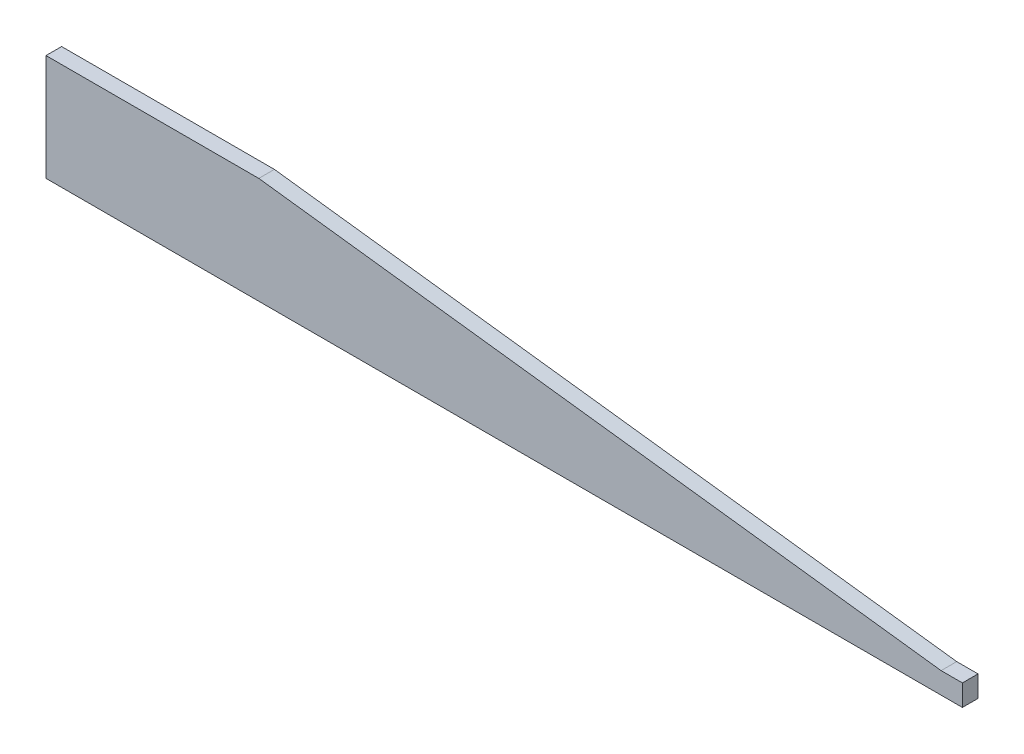
ISO-10303-21;
HEADER;
FILE_DESCRIPTION(('STEP AP214'),'2;1');
FILE_NAME('part.step','',(''),(''),'','','');
FILE_SCHEMA(('AUTOMOTIVE_DESIGN { 1 0 10303 214 1 1 1 1 }'));
ENDSEC;
DATA;
#1=APPLICATION_CONTEXT('core data for automotive mechanical design processes');
#2=APPLICATION_PROTOCOL_DEFINITION('international standard','automotive_design',2000,#1);
#3=PRODUCT_CONTEXT('',#1,'mechanical');
#4=PRODUCT('Part','Part','',(#3));
#5=PRODUCT_RELATED_PRODUCT_CATEGORY('part','',(#4));
#6=PRODUCT_DEFINITION_FORMATION('','',#4);
#7=PRODUCT_DEFINITION_CONTEXT('part definition',#1,'design');
#8=PRODUCT_DEFINITION('design','',#6,#7);
#9=PRODUCT_DEFINITION_SHAPE('','',#8);
#10=(LENGTH_UNIT() NAMED_UNIT(*) SI_UNIT(.MILLI.,.METRE.));
#11=(NAMED_UNIT(*) PLANE_ANGLE_UNIT() SI_UNIT($,.RADIAN.));
#12=(NAMED_UNIT(*) SI_UNIT($,.STERADIAN.) SOLID_ANGLE_UNIT());
#13=UNCERTAINTY_MEASURE_WITH_UNIT(LENGTH_MEASURE(1.E-05),#10,'distance_accuracy_value','');
#14=(GEOMETRIC_REPRESENTATION_CONTEXT(3) GLOBAL_UNCERTAINTY_ASSIGNED_CONTEXT((#13)) GLOBAL_UNIT_ASSIGNED_CONTEXT((#10,
#11,#12)) REPRESENTATION_CONTEXT('',''));
#15=CARTESIAN_POINT('',(0.,0.,0.));
#16=DIRECTION('',(0.,0.,1.));
#17=DIRECTION('',(1.,0.,0.));
#18=AXIS2_PLACEMENT_3D('',#15,#16,#17);
#19=CARTESIAN_POINT('',(-0.0100000000000477,-150.01,22.));
#20=DIRECTION('',(0.,0.,1.));
#21=DIRECTION('',(1.,0.,0.));
#22=AXIS2_PLACEMENT_3D('',#19,#20,#21);
#23=PLANE('',#22);
#24=DIRECTION('',(0.,1.,0.));
#25=VECTOR('',#24,1.);
#26=CARTESIAN_POINT('',(0.,-75.,22.));
#27=LINE('',#26,#25);
#28=CARTESIAN_POINT('',(0.,-150.,22.));
#29=VERTEX_POINT('',#28);
#30=CARTESIAN_POINT('',(0.,0.,22.));
#31=VERTEX_POINT('',#30);
#32=EDGE_CURVE('E100',#29,#31,#27,.T.);
#33=ORIENTED_EDGE('',*,*,#32,.F.);
#34=DIRECTION('',(-1.,0.,0.));
#35=VECTOR('',#34,1.);
#36=CARTESIAN_POINT('',(646.,-150.,22.));
#37=LINE('',#36,#35);
#38=CARTESIAN_POINT('',(1292.,-150.,22.));
#39=VERTEX_POINT('',#38);
#40=EDGE_CURVE('E95',#39,#29,#37,.T.);
#41=ORIENTED_EDGE('',*,*,#40,.F.);
#42=DIRECTION('',(0.,-1.,0.));
#43=VECTOR('',#42,1.);
#44=CARTESIAN_POINT('',(1292.,-135.,22.));
#45=LINE('',#44,#43);
#46=CARTESIAN_POINT('',(1292.,-120.,22.));
#47=VERTEX_POINT('',#46);
#48=EDGE_CURVE('E112',#47,#39,#45,.T.);
#49=ORIENTED_EDGE('',*,*,#48,.F.);
#50=DIRECTION('',(1.,0.,0.));
#51=VECTOR('',#50,1.);
#52=CARTESIAN_POINT('',(1277.,-120.,22.));
#53=LINE('',#52,#51);
#54=CARTESIAN_POINT('',(1262.,-120.,22.));
#55=VERTEX_POINT('',#54);
#56=EDGE_CURVE('E81',#55,#47,#53,.T.);
#57=ORIENTED_EDGE('',*,*,#56,.F.);
#58=DIRECTION('',(0.992309582899912,-0.123780821151755,0.));
#59=VECTOR('',#58,1.);
#60=CARTESIAN_POINT('',(781.,-59.9999999999998,22.));
#61=LINE('',#60,#59);
#62=CARTESIAN_POINT('',(300.,0.,22.));
#63=VERTEX_POINT('',#62);
#64=EDGE_CURVE('E78',#63,#55,#61,.T.);
#65=ORIENTED_EDGE('',*,*,#64,.F.);
#66=DIRECTION('',(1.,0.,0.));
#67=VECTOR('',#66,1.);
#68=CARTESIAN_POINT('',(275.,0.,22.));
#69=LINE('',#68,#67);
#70=EDGE_CURVE('E99',#31,#63,#69,.T.);
#71=ORIENTED_EDGE('',*,*,#70,.F.);
#72=EDGE_LOOP('',(#33,#41,#49,#57,#65,#71));
#73=FACE_BOUND('',#72,.T.);
#74=ADVANCED_FACE('F17',(#73),#23,.T.);
#75=CARTESIAN_POINT('',(0.,0.01,-0.01));
#76=DIRECTION('',(-1.,0.,0.));
#77=DIRECTION('',(0.,-1.,0.));
#78=AXIS2_PLACEMENT_3D('',#75,#76,#77);
#79=PLANE('',#78);
#80=ORIENTED_EDGE('',*,*,#32,.T.);
#81=DIRECTION('',(0.,0.,-1.));
#82=VECTOR('',#81,1.);
#83=CARTESIAN_POINT('',(0.,0.,11.));
#84=LINE('',#83,#82);
#85=CARTESIAN_POINT('',(0.,0.,0.));
#86=VERTEX_POINT('',#85);
#87=EDGE_CURVE('E103',#31,#86,#84,.T.);
#88=ORIENTED_EDGE('',*,*,#87,.T.);
#89=DIRECTION('',(0.,1.,0.));
#90=VECTOR('',#89,1.);
#91=CARTESIAN_POINT('',(0.,-75.,0.));
#92=LINE('',#91,#90);
#93=CARTESIAN_POINT('',(0.,-150.,0.));
#94=VERTEX_POINT('',#93);
#95=EDGE_CURVE('E106',#94,#86,#92,.T.);
#96=ORIENTED_EDGE('',*,*,#95,.F.);
#97=DIRECTION('',(0.,0.,-1.));
#98=VECTOR('',#97,1.);
#99=CARTESIAN_POINT('',(0.,-150.,11.));
#100=LINE('',#99,#98);
#101=EDGE_CURVE('E92',#29,#94,#100,.T.);
#102=ORIENTED_EDGE('',*,*,#101,.F.);
#103=EDGE_LOOP('',(#80,#88,#96,#102));
#104=FACE_BOUND('',#103,.T.);
#105=ADVANCED_FACE('F125',(#104),#79,.T.);
#106=CARTESIAN_POINT('',(300.01,0.,-0.01));
#107=DIRECTION('',(0.,1.,0.));
#108=DIRECTION('',(-1.,0.,0.));
#109=AXIS2_PLACEMENT_3D('',#106,#107,#108);
#110=PLANE('',#109);
#111=DIRECTION('',(0.,0.,1.));
#112=VECTOR('',#111,1.);
#113=CARTESIAN_POINT('',(300.,0.,11.));
#114=LINE('',#113,#112);
#115=CARTESIAN_POINT('',(300.,0.,0.));
#116=VERTEX_POINT('',#115);
#117=EDGE_CURVE('E67',#116,#63,#114,.T.);
#118=ORIENTED_EDGE('',*,*,#117,.F.);
#119=DIRECTION('',(1.,0.,0.));
#120=VECTOR('',#119,1.);
#121=CARTESIAN_POINT('',(771.,0.,0.));
#122=LINE('',#121,#120);
#123=EDGE_CURVE('E91',#86,#116,#122,.T.);
#124=ORIENTED_EDGE('',*,*,#123,.F.);
#125=ORIENTED_EDGE('',*,*,#87,.F.);
#126=ORIENTED_EDGE('',*,*,#70,.T.);
#127=EDGE_LOOP('',(#118,#124,#125,#126));
#128=FACE_BOUND('',#127,.T.);
#129=ADVANCED_FACE('F127',(#128),#110,.T.);
#130=CARTESIAN_POINT('',(1262.00992309583,-120.001237808211,-0.01));
#131=DIRECTION('',(0.123780821151755,0.992309582899912,0.));
#132=DIRECTION('',(-0.992309582899912,0.123780821151755,0.));
#133=AXIS2_PLACEMENT_3D('',#130,#131,#132);
#134=PLANE('',#133);
#135=ORIENTED_EDGE('',*,*,#64,.T.);
#136=DIRECTION('',(0.,0.,1.));
#137=VECTOR('',#136,1.);
#138=CARTESIAN_POINT('',(1262.,-120.,11.));
#139=LINE('',#138,#137);
#140=CARTESIAN_POINT('',(1262.,-120.,0.));
#141=VERTEX_POINT('',#140);
#142=EDGE_CURVE('E72',#141,#55,#139,.T.);
#143=ORIENTED_EDGE('',*,*,#142,.F.);
#144=DIRECTION('',(0.992309582899912,-0.123780821151756,0.));
#145=VECTOR('',#144,1.);
#146=CARTESIAN_POINT('',(300.,0.,0.));
#147=LINE('',#146,#145);
#148=EDGE_CURVE('E21',#116,#141,#147,.T.);
#149=ORIENTED_EDGE('',*,*,#148,.F.);
#150=ORIENTED_EDGE('',*,*,#117,.T.);
#151=EDGE_LOOP('',(#135,#143,#149,#150));
#152=FACE_BOUND('',#151,.T.);
#153=ADVANCED_FACE('F74',(#152),#134,.T.);
#154=CARTESIAN_POINT('',(1292.01,-120.,-0.01));
#155=DIRECTION('',(0.,1.,0.));
#156=DIRECTION('',(-1.,0.,0.));
#157=AXIS2_PLACEMENT_3D('',#154,#155,#156);
#158=PLANE('',#157);
#159=ORIENTED_EDGE('',*,*,#56,.T.);
#160=DIRECTION('',(0.,0.,1.));
#161=VECTOR('',#160,1.);
#162=CARTESIAN_POINT('',(1292.,-120.,11.));
#163=LINE('',#162,#161);
#164=CARTESIAN_POINT('',(1292.,-120.,0.));
#165=VERTEX_POINT('',#164);
#166=EDGE_CURVE('E87',#165,#47,#163,.T.);
#167=ORIENTED_EDGE('',*,*,#166,.F.);
#168=DIRECTION('',(1.,0.,0.));
#169=VECTOR('',#168,1.);
#170=CARTESIAN_POINT('',(771.,-120.,0.));
#171=LINE('',#170,#169);
#172=EDGE_CURVE('E84',#141,#165,#171,.T.);
#173=ORIENTED_EDGE('',*,*,#172,.F.);
#174=ORIENTED_EDGE('',*,*,#142,.T.);
#175=EDGE_LOOP('',(#159,#167,#173,#174));
#176=FACE_BOUND('',#175,.T.);
#177=ADVANCED_FACE('F85',(#176),#158,.T.);
#178=CARTESIAN_POINT('',(1292.,-150.01,-0.01));
#179=DIRECTION('',(1.,0.,0.));
#180=DIRECTION('',(0.,1.,0.));
#181=AXIS2_PLACEMENT_3D('',#178,#179,#180);
#182=PLANE('',#181);
#183=ORIENTED_EDGE('',*,*,#48,.T.);
#184=DIRECTION('',(0.,0.,1.));
#185=VECTOR('',#184,1.);
#186=CARTESIAN_POINT('',(1292.,-150.,11.));
#187=LINE('',#186,#185);
#188=CARTESIAN_POINT('',(1292.,-150.,0.));
#189=VERTEX_POINT('',#188);
#190=EDGE_CURVE('E36',#189,#39,#187,.T.);
#191=ORIENTED_EDGE('',*,*,#190,.F.);
#192=DIRECTION('',(0.,-1.,0.));
#193=VECTOR('',#192,1.);
#194=CARTESIAN_POINT('',(1292.,-75.,0.));
#195=LINE('',#194,#193);
#196=EDGE_CURVE('E27',#165,#189,#195,.T.);
#197=ORIENTED_EDGE('',*,*,#196,.F.);
#198=ORIENTED_EDGE('',*,*,#166,.T.);
#199=EDGE_LOOP('',(#183,#191,#197,#198));
#200=FACE_BOUND('',#199,.T.);
#201=ADVANCED_FACE('F118',(#200),#182,.T.);
#202=CARTESIAN_POINT('',(-0.01,-150.,-0.01));
#203=DIRECTION('',(0.,-1.,0.));
#204=DIRECTION('',(1.,0.,0.));
#205=AXIS2_PLACEMENT_3D('',#202,#203,#204);
#206=PLANE('',#205);
#207=ORIENTED_EDGE('',*,*,#101,.T.);
#208=DIRECTION('',(-1.,0.,0.));
#209=VECTOR('',#208,1.);
#210=CARTESIAN_POINT('',(771.,-150.,0.));
#211=LINE('',#210,#209);
#212=EDGE_CURVE('E11',#189,#94,#211,.T.);
#213=ORIENTED_EDGE('',*,*,#212,.F.);
#214=ORIENTED_EDGE('',*,*,#190,.T.);
#215=ORIENTED_EDGE('',*,*,#40,.T.);
#216=EDGE_LOOP('',(#207,#213,#214,#215));
#217=FACE_BOUND('',#216,.T.);
#218=ADVANCED_FACE('F122',(#217),#206,.T.);
#219=CARTESIAN_POINT('',(1292.01,-150.01,0.));
#220=DIRECTION('',(0.,0.,-1.));
#221=DIRECTION('',(-1.,0.,0.));
#222=AXIS2_PLACEMENT_3D('',#219,#220,#221);
#223=PLANE('',#222);
#224=ORIENTED_EDGE('',*,*,#196,.T.);
#225=ORIENTED_EDGE('',*,*,#212,.T.);
#226=ORIENTED_EDGE('',*,*,#95,.T.);
#227=ORIENTED_EDGE('',*,*,#123,.T.);
#228=ORIENTED_EDGE('',*,*,#148,.T.);
#229=ORIENTED_EDGE('',*,*,#172,.T.);
#230=EDGE_LOOP('',(#224,#225,#226,#227,#228,#229));
#231=FACE_BOUND('',#230,.T.);
#232=ADVANCED_FACE('F19',(#231),#223,.T.);
#233=CLOSED_SHELL('',(#74,#105,#129,#153,#177,#201,#218,#232));
#234=MANIFOLD_SOLID_BREP('B1',#233);
#235=ADVANCED_BREP_SHAPE_REPRESENTATION('',(#18,#234),#14);
#236=SHAPE_DEFINITION_REPRESENTATION(#9,#235);
ENDSEC;
END-ISO-10303-21;
